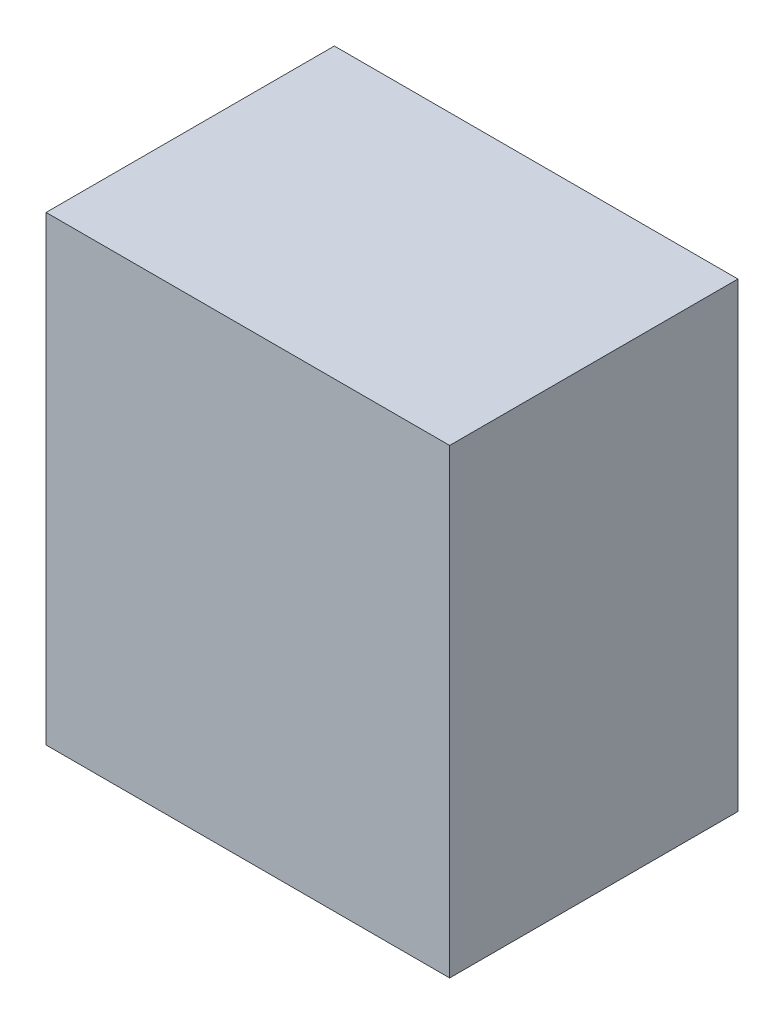
ISO-10303-21;
HEADER;
FILE_DESCRIPTION(('STEP AP214'),'2;1');
FILE_NAME('part.step','',(''),(''),'','','');
FILE_SCHEMA(('AUTOMOTIVE_DESIGN { 1 0 10303 214 1 1 1 1 }'));
ENDSEC;
DATA;
#1=APPLICATION_CONTEXT('core data for automotive mechanical design processes');
#2=APPLICATION_PROTOCOL_DEFINITION('international standard','automotive_design',2000,#1);
#3=PRODUCT_CONTEXT('',#1,'mechanical');
#4=PRODUCT('Part','Part','',(#3));
#5=PRODUCT_RELATED_PRODUCT_CATEGORY('part','',(#4));
#6=PRODUCT_DEFINITION_FORMATION('','',#4);
#7=PRODUCT_DEFINITION_CONTEXT('part definition',#1,'design');
#8=PRODUCT_DEFINITION('design','',#6,#7);
#9=PRODUCT_DEFINITION_SHAPE('','',#8);
#10=(LENGTH_UNIT() NAMED_UNIT(*) SI_UNIT(.MILLI.,.METRE.));
#11=(NAMED_UNIT(*) PLANE_ANGLE_UNIT() SI_UNIT($,.RADIAN.));
#12=(NAMED_UNIT(*) SI_UNIT($,.STERADIAN.) SOLID_ANGLE_UNIT());
#13=UNCERTAINTY_MEASURE_WITH_UNIT(LENGTH_MEASURE(1.E-05),#10,'distance_accuracy_value','');
#14=(GEOMETRIC_REPRESENTATION_CONTEXT(3) GLOBAL_UNCERTAINTY_ASSIGNED_CONTEXT((#13)) GLOBAL_UNIT_ASSIGNED_CONTEXT((#10,
#11,#12)) REPRESENTATION_CONTEXT('',''));
#15=CARTESIAN_POINT('',(0.,0.,0.));
#16=DIRECTION('',(0.,0.,1.));
#17=DIRECTION('',(1.,0.,0.));
#18=AXIS2_PLACEMENT_3D('',#15,#16,#17);
#19=CARTESIAN_POINT('',(0.,0.,25.));
#20=DIRECTION('',(1.,0.,0.));
#21=DIRECTION('',(0.,0.,-1.));
#22=AXIS2_PLACEMENT_3D('',#19,#20,#21);
#23=PLANE('',#22);
#24=DIRECTION('',(0.,-1.,0.));
#25=VECTOR('',#24,1.);
#26=CARTESIAN_POINT('',(0.,0.,0.));
#27=LINE('',#26,#25);
#28=CARTESIAN_POINT('',(0.,40.,0.));
#29=VERTEX_POINT('',#28);
#30=CARTESIAN_POINT('',(0.,0.,0.));
#31=VERTEX_POINT('',#30);
#32=EDGE_CURVE('E107',#29,#31,#27,.T.);
#33=ORIENTED_EDGE('',*,*,#32,.T.);
#34=DIRECTION('',(0.,0.,-1.));
#35=VECTOR('',#34,1.);
#36=CARTESIAN_POINT('',(0.,0.,25.));
#37=LINE('',#36,#35);
#38=CARTESIAN_POINT('',(0.,0.,25.));
#39=VERTEX_POINT('',#38);
#40=EDGE_CURVE('E11',#39,#31,#37,.T.);
#41=ORIENTED_EDGE('',*,*,#40,.F.);
#42=DIRECTION('',(0.,-1.,0.));
#43=VECTOR('',#42,1.);
#44=CARTESIAN_POINT('',(0.,0.,25.));
#45=LINE('',#44,#43);
#46=CARTESIAN_POINT('',(0.,40.,25.));
#47=VERTEX_POINT('',#46);
#48=EDGE_CURVE('E91',#47,#39,#45,.T.);
#49=ORIENTED_EDGE('',*,*,#48,.F.);
#50=DIRECTION('',(0.,0.,-1.));
#51=VECTOR('',#50,1.);
#52=CARTESIAN_POINT('',(0.,40.,25.));
#53=LINE('',#52,#51);
#54=EDGE_CURVE('E103',#47,#29,#53,.T.);
#55=ORIENTED_EDGE('',*,*,#54,.T.);
#56=EDGE_LOOP('',(#33,#41,#49,#55));
#57=FACE_BOUND('',#56,.T.);
#58=ADVANCED_FACE('F39',(#57),#23,.F.);
#59=CARTESIAN_POINT('',(0.,0.,25.));
#60=DIRECTION('',(0.,1.,0.));
#61=DIRECTION('',(-1.,0.,0.));
#62=AXIS2_PLACEMENT_3D('',#59,#60,#61);
#63=PLANE('',#62);
#64=DIRECTION('',(1.,0.,0.));
#65=VECTOR('',#64,1.);
#66=CARTESIAN_POINT('',(0.,0.,0.));
#67=LINE('',#66,#65);
#68=CARTESIAN_POINT('',(35.,0.,0.));
#69=VERTEX_POINT('',#68);
#70=EDGE_CURVE('E96',#31,#69,#67,.T.);
#71=ORIENTED_EDGE('',*,*,#70,.T.);
#72=DIRECTION('',(0.,0.,-1.));
#73=VECTOR('',#72,1.);
#74=CARTESIAN_POINT('',(35.,0.,25.));
#75=LINE('',#74,#73);
#76=CARTESIAN_POINT('',(35.,0.,25.));
#77=VERTEX_POINT('',#76);
#78=EDGE_CURVE('E48',#77,#69,#75,.T.);
#79=ORIENTED_EDGE('',*,*,#78,.F.);
#80=DIRECTION('',(1.,0.,0.));
#81=VECTOR('',#80,1.);
#82=CARTESIAN_POINT('',(0.,0.,25.));
#83=LINE('',#82,#81);
#84=EDGE_CURVE('E86',#39,#77,#83,.T.);
#85=ORIENTED_EDGE('',*,*,#84,.F.);
#86=ORIENTED_EDGE('',*,*,#40,.T.);
#87=EDGE_LOOP('',(#71,#79,#85,#86));
#88=FACE_BOUND('',#87,.T.);
#89=ADVANCED_FACE('F95',(#88),#63,.F.);
#90=CARTESIAN_POINT('',(35.,0.,25.));
#91=DIRECTION('',(-1.,0.,0.));
#92=DIRECTION('',(0.,-1.,0.));
#93=AXIS2_PLACEMENT_3D('',#90,#91,#92);
#94=PLANE('',#93);
#95=DIRECTION('',(0.,1.,0.));
#96=VECTOR('',#95,1.);
#97=CARTESIAN_POINT('',(35.,0.,0.));
#98=LINE('',#97,#96);
#99=CARTESIAN_POINT('',(35.,40.,0.));
#100=VERTEX_POINT('',#99);
#101=EDGE_CURVE('E73',#69,#100,#98,.T.);
#102=ORIENTED_EDGE('',*,*,#101,.T.);
#103=DIRECTION('',(0.,0.,-1.));
#104=VECTOR('',#103,1.);
#105=CARTESIAN_POINT('',(35.,40.,25.));
#106=LINE('',#105,#104);
#107=CARTESIAN_POINT('',(35.,40.,25.));
#108=VERTEX_POINT('',#107);
#109=EDGE_CURVE('E98',#108,#100,#106,.T.);
#110=ORIENTED_EDGE('',*,*,#109,.F.);
#111=DIRECTION('',(0.,1.,0.));
#112=VECTOR('',#111,1.);
#113=CARTESIAN_POINT('',(35.,0.,25.));
#114=LINE('',#113,#112);
#115=EDGE_CURVE('E89',#77,#108,#114,.T.);
#116=ORIENTED_EDGE('',*,*,#115,.F.);
#117=ORIENTED_EDGE('',*,*,#78,.T.);
#118=EDGE_LOOP('',(#102,#110,#116,#117));
#119=FACE_BOUND('',#118,.T.);
#120=ADVANCED_FACE('F99',(#119),#94,.F.);
#121=CARTESIAN_POINT('',(0.,40.,25.));
#122=DIRECTION('',(0.,-1.,0.));
#123=DIRECTION('',(1.,0.,0.));
#124=AXIS2_PLACEMENT_3D('',#121,#122,#123);
#125=PLANE('',#124);
#126=DIRECTION('',(-1.,0.,0.));
#127=VECTOR('',#126,1.);
#128=CARTESIAN_POINT('',(0.,40.,0.));
#129=LINE('',#128,#127);
#130=EDGE_CURVE('E79',#100,#29,#129,.T.);
#131=ORIENTED_EDGE('',*,*,#130,.T.);
#132=ORIENTED_EDGE('',*,*,#54,.F.);
#133=DIRECTION('',(-1.,0.,0.));
#134=VECTOR('',#133,1.);
#135=CARTESIAN_POINT('',(0.,40.,25.));
#136=LINE('',#135,#134);
#137=EDGE_CURVE('E56',#108,#47,#136,.T.);
#138=ORIENTED_EDGE('',*,*,#137,.F.);
#139=ORIENTED_EDGE('',*,*,#109,.T.);
#140=EDGE_LOOP('',(#131,#132,#138,#139));
#141=FACE_BOUND('',#140,.T.);
#142=ADVANCED_FACE('F120',(#141),#125,.F.);
#143=CARTESIAN_POINT('',(0.,0.,25.));
#144=DIRECTION('',(0.,0.,-1.));
#145=DIRECTION('',(-1.,0.,0.));
#146=AXIS2_PLACEMENT_3D('',#143,#144,#145);
#147=PLANE('',#146);
#148=ORIENTED_EDGE('',*,*,#48,.T.);
#149=ORIENTED_EDGE('',*,*,#84,.T.);
#150=ORIENTED_EDGE('',*,*,#115,.T.);
#151=ORIENTED_EDGE('',*,*,#137,.T.);
#152=EDGE_LOOP('',(#148,#149,#150,#151));
#153=FACE_BOUND('',#152,.T.);
#154=ADVANCED_FACE('F87',(#153),#147,.F.);
#155=CARTESIAN_POINT('',(0.,0.,0.));
#156=DIRECTION('',(0.,0.,-1.));
#157=DIRECTION('',(-1.,0.,0.));
#158=AXIS2_PLACEMENT_3D('',#155,#156,#157);
#159=PLANE('',#158);
#160=ORIENTED_EDGE('',*,*,#32,.F.);
#161=ORIENTED_EDGE('',*,*,#130,.F.);
#162=ORIENTED_EDGE('',*,*,#101,.F.);
#163=ORIENTED_EDGE('',*,*,#70,.F.);
#164=EDGE_LOOP('',(#160,#161,#162,#163));
#165=FACE_BOUND('',#164,.T.);
#166=ADVANCED_FACE('F123',(#165),#159,.T.);
#167=CLOSED_SHELL('',(#58,#89,#120,#142,#154,#166));
#168=MANIFOLD_SOLID_BREP('B2',#167);
#169=ADVANCED_BREP_SHAPE_REPRESENTATION('',(#18,#168),#14);
#170=SHAPE_DEFINITION_REPRESENTATION(#9,#169);
ENDSEC;
END-ISO-10303-21;
